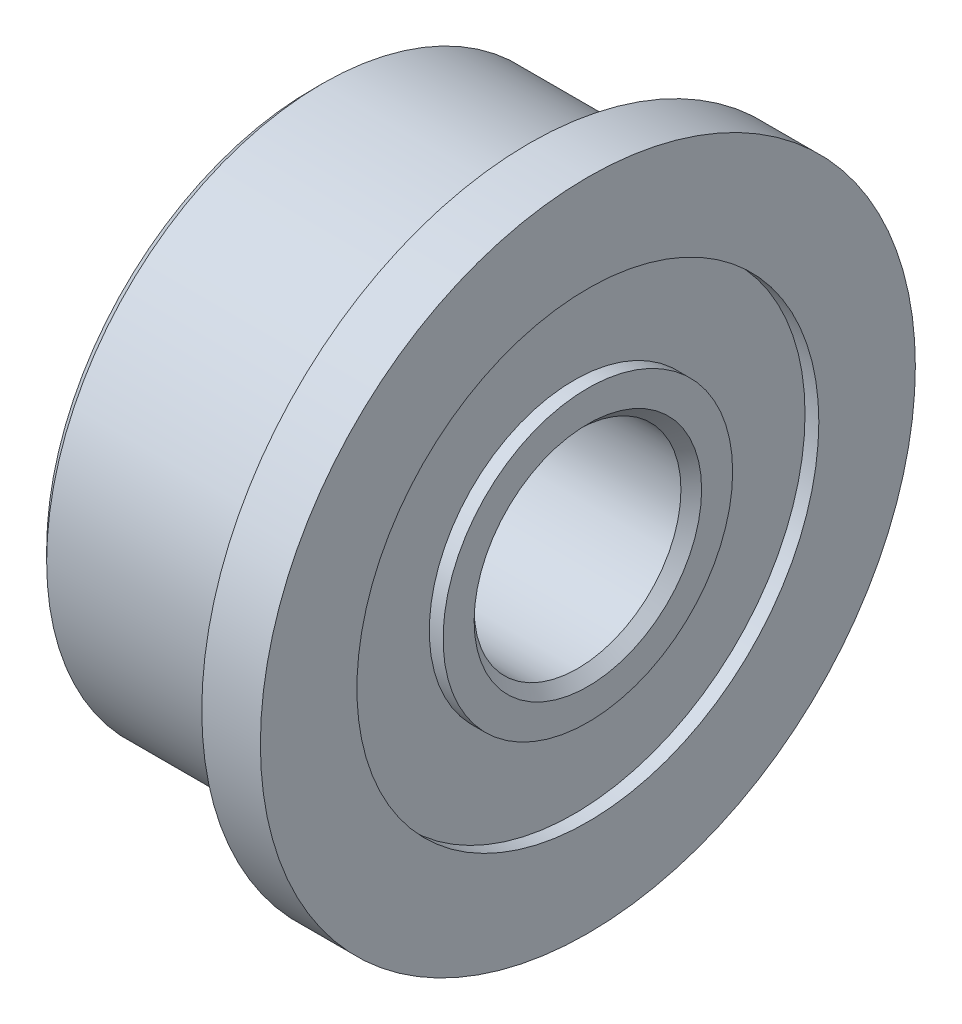
ISO-10303-21;
HEADER;
FILE_DESCRIPTION(('STEP AP214'),'2;1');
FILE_NAME('part.step','',(''),(''),'','','');
FILE_SCHEMA(('AUTOMOTIVE_DESIGN { 1 0 10303 214 1 1 1 1 }'));
ENDSEC;
DATA;
#1=APPLICATION_CONTEXT('core data for automotive mechanical design processes');
#2=APPLICATION_PROTOCOL_DEFINITION('international standard','automotive_design',2000,#1);
#3=PRODUCT_CONTEXT('',#1,'mechanical');
#4=PRODUCT('Part','Part','',(#3));
#5=PRODUCT_RELATED_PRODUCT_CATEGORY('part','',(#4));
#6=PRODUCT_DEFINITION_FORMATION('','',#4);
#7=PRODUCT_DEFINITION_CONTEXT('part definition',#1,'design');
#8=PRODUCT_DEFINITION('design','',#6,#7);
#9=PRODUCT_DEFINITION_SHAPE('','',#8);
#10=(LENGTH_UNIT() NAMED_UNIT(*) SI_UNIT(.MILLI.,.METRE.));
#11=(NAMED_UNIT(*) PLANE_ANGLE_UNIT() SI_UNIT($,.RADIAN.));
#12=(NAMED_UNIT(*) SI_UNIT($,.STERADIAN.) SOLID_ANGLE_UNIT());
#13=UNCERTAINTY_MEASURE_WITH_UNIT(LENGTH_MEASURE(1.E-05),#10,'distance_accuracy_value','');
#14=(GEOMETRIC_REPRESENTATION_CONTEXT(3) GLOBAL_UNCERTAINTY_ASSIGNED_CONTEXT((#13)) GLOBAL_UNIT_ASSIGNED_CONTEXT((#10,
#11,#12)) REPRESENTATION_CONTEXT('',''));
#15=CARTESIAN_POINT('',(0.,0.,0.));
#16=DIRECTION('',(0.,0.,1.));
#17=DIRECTION('',(1.,0.,0.));
#18=AXIS2_PLACEMENT_3D('',#15,#16,#17);
#19=CARTESIAN_POINT('',(-4.,2.1,0.));
#20=DIRECTION('',(-1.,0.,0.));
#21=DIRECTION('',(0.,0.,1.));
#22=AXIS2_PLACEMENT_3D('',#19,#20,#21);
#23=PLANE('',#22);
#24=CARTESIAN_POINT('',(-4.,0.,0.));
#25=DIRECTION('',(1.,0.,0.));
#26=DIRECTION('',(0.,0.,-1.));
#27=AXIS2_PLACEMENT_3D('',#24,#25,#26);
#28=CIRCLE('',#27,2.1);
#29=CARTESIAN_POINT('',(-4.,0.,-2.1));
#30=VERTEX_POINT('',#29);
#31=EDGE_CURVE('E77',#30,#30,#28,.T.);
#32=ORIENTED_EDGE('',*,*,#31,.F.);
#33=EDGE_LOOP('',(#32));
#34=FACE_BOUND('',#33,.T.);
#35=CARTESIAN_POINT('',(-4.,0.,0.));
#36=DIRECTION('',(-1.,0.,0.));
#37=DIRECTION('',(0.,0.,1.));
#38=AXIS2_PLACEMENT_3D('',#35,#36,#37);
#39=CIRCLE('',#38,1.65);
#40=CARTESIAN_POINT('',(-4.,0.,1.65));
#41=VERTEX_POINT('',#40);
#42=EDGE_CURVE('E89',#41,#41,#39,.F.);
#43=ORIENTED_EDGE('',*,*,#42,.T.);
#44=EDGE_LOOP('',(#43));
#45=FACE_BOUND('',#44,.T.);
#46=ADVANCED_FACE('F14',(#34,#45),#23,.T.);
#47=CARTESIAN_POINT('',(0.,1.5,0.));
#48=DIRECTION('',(1.,0.,0.));
#49=DIRECTION('',(0.,0.,-1.));
#50=AXIS2_PLACEMENT_3D('',#47,#48,#49);
#51=PLANE('',#50);
#52=CARTESIAN_POINT('',(0.,0.,0.));
#53=DIRECTION('',(1.,0.,0.));
#54=DIRECTION('',(0.,0.,-1.));
#55=AXIS2_PLACEMENT_3D('',#52,#53,#54);
#56=CIRCLE('',#55,2.1);
#57=CARTESIAN_POINT('',(0.,0.,-2.1));
#58=VERTEX_POINT('',#57);
#59=EDGE_CURVE('E29',#58,#58,#56,.T.);
#60=ORIENTED_EDGE('',*,*,#59,.T.);
#61=EDGE_LOOP('',(#60));
#62=FACE_BOUND('',#61,.T.);
#63=CARTESIAN_POINT('',(0.,0.,0.));
#64=DIRECTION('',(1.,0.,0.));
#65=DIRECTION('',(0.,0.,-1.));
#66=AXIS2_PLACEMENT_3D('',#63,#64,#65);
#67=CIRCLE('',#66,1.65);
#68=CARTESIAN_POINT('',(0.,0.,-1.65));
#69=VERTEX_POINT('',#68);
#70=EDGE_CURVE('E93',#69,#69,#67,.F.);
#71=ORIENTED_EDGE('',*,*,#70,.T.);
#72=EDGE_LOOP('',(#71));
#73=FACE_BOUND('',#72,.T.);
#74=ADVANCED_FACE('F101',(#62,#73),#51,.T.);
#75=CARTESIAN_POINT('',(0.,0.,0.));
#76=DIRECTION('',(1.,0.,0.));
#77=DIRECTION('',(0.,0.,-1.));
#78=AXIS2_PLACEMENT_3D('',#75,#76,#77);
#79=CYLINDRICAL_SURFACE('',#78,2.1);
#80=CARTESIAN_POINT('',(-0.2,0.,0.));
#81=DIRECTION('',(1.,0.,0.));
#82=DIRECTION('',(0.,0.,-1.));
#83=AXIS2_PLACEMENT_3D('',#80,#81,#82);
#84=CIRCLE('',#83,2.1);
#85=CARTESIAN_POINT('',(-0.2,0.,-2.1));
#86=VERTEX_POINT('',#85);
#87=EDGE_CURVE('E35',#86,#86,#84,.T.);
#88=ORIENTED_EDGE('',*,*,#87,.T.);
#89=EDGE_LOOP('',(#88));
#90=FACE_BOUND('',#89,.T.);
#91=ORIENTED_EDGE('',*,*,#59,.F.);
#92=EDGE_LOOP('',(#91));
#93=FACE_BOUND('',#92,.T.);
#94=ADVANCED_FACE('F127',(#90,#93),#79,.T.);
#95=CARTESIAN_POINT('',(-0.2,3.35,0.));
#96=DIRECTION('',(1.,0.,0.));
#97=DIRECTION('',(0.,0.,-1.));
#98=AXIS2_PLACEMENT_3D('',#95,#96,#97);
#99=PLANE('',#98);
#100=CARTESIAN_POINT('',(-0.2,0.,0.));
#101=DIRECTION('',(1.,0.,0.));
#102=DIRECTION('',(0.,0.,-1.));
#103=AXIS2_PLACEMENT_3D('',#100,#101,#102);
#104=CIRCLE('',#103,3.35);
#105=CARTESIAN_POINT('',(-0.2,0.,-3.35));
#106=VERTEX_POINT('',#105);
#107=EDGE_CURVE('E41',#106,#106,#104,.T.);
#108=ORIENTED_EDGE('',*,*,#107,.T.);
#109=EDGE_LOOP('',(#108));
#110=FACE_BOUND('',#109,.T.);
#111=ORIENTED_EDGE('',*,*,#87,.F.);
#112=EDGE_LOOP('',(#111));
#113=FACE_BOUND('',#112,.T.);
#114=ADVANCED_FACE('F134',(#110,#113),#99,.T.);
#115=CARTESIAN_POINT('',(0.,0.,0.));
#116=DIRECTION('',(1.,0.,0.));
#117=DIRECTION('',(0.,0.,-1.));
#118=AXIS2_PLACEMENT_3D('',#115,#116,#117);
#119=CYLINDRICAL_SURFACE('',#118,3.35);
#120=CARTESIAN_POINT('',(0.,0.,0.));
#121=DIRECTION('',(1.,0.,0.));
#122=DIRECTION('',(0.,0.,-1.));
#123=AXIS2_PLACEMENT_3D('',#120,#121,#122);
#124=CIRCLE('',#123,3.35);
#125=CARTESIAN_POINT('',(0.,0.,-3.35));
#126=VERTEX_POINT('',#125);
#127=EDGE_CURVE('E45',#126,#126,#124,.T.);
#128=ORIENTED_EDGE('',*,*,#127,.T.);
#129=EDGE_LOOP('',(#128));
#130=FACE_BOUND('',#129,.T.);
#131=ORIENTED_EDGE('',*,*,#107,.F.);
#132=EDGE_LOOP('',(#131));
#133=FACE_BOUND('',#132,.T.);
#134=ADVANCED_FACE('F138',(#130,#133),#119,.F.);
#135=CARTESIAN_POINT('',(0.,3.35,0.));
#136=DIRECTION('',(1.,0.,0.));
#137=DIRECTION('',(0.,0.,-1.));
#138=AXIS2_PLACEMENT_3D('',#135,#136,#137);
#139=PLANE('',#138);
#140=CARTESIAN_POINT('',(0.,0.,0.));
#141=DIRECTION('',(1.,0.,0.));
#142=DIRECTION('',(0.,0.,-1.));
#143=AXIS2_PLACEMENT_3D('',#140,#141,#142);
#144=CIRCLE('',#143,4.75);
#145=CARTESIAN_POINT('',(0.,0.,-4.75));
#146=VERTEX_POINT('',#145);
#147=EDGE_CURVE('E49',#146,#146,#144,.T.);
#148=ORIENTED_EDGE('',*,*,#147,.T.);
#149=EDGE_LOOP('',(#148));
#150=FACE_BOUND('',#149,.T.);
#151=ORIENTED_EDGE('',*,*,#127,.F.);
#152=EDGE_LOOP('',(#151));
#153=FACE_BOUND('',#152,.T.);
#154=ADVANCED_FACE('F142',(#150,#153),#139,.T.);
#155=CARTESIAN_POINT('',(0.,0.,0.));
#156=DIRECTION('',(1.,0.,0.));
#157=DIRECTION('',(0.,0.,-1.));
#158=AXIS2_PLACEMENT_3D('',#155,#156,#157);
#159=CYLINDRICAL_SURFACE('',#158,4.75);
#160=CARTESIAN_POINT('',(-0.85,0.,0.));
#161=DIRECTION('',(1.,0.,0.));
#162=DIRECTION('',(0.,0.,-1.));
#163=AXIS2_PLACEMENT_3D('',#160,#161,#162);
#164=CIRCLE('',#163,4.75);
#165=CARTESIAN_POINT('',(-0.85,0.,-4.75));
#166=VERTEX_POINT('',#165);
#167=EDGE_CURVE('E53',#166,#166,#164,.T.);
#168=ORIENTED_EDGE('',*,*,#167,.T.);
#169=EDGE_LOOP('',(#168));
#170=FACE_BOUND('',#169,.T.);
#171=ORIENTED_EDGE('',*,*,#147,.F.);
#172=EDGE_LOOP('',(#171));
#173=FACE_BOUND('',#172,.T.);
#174=ADVANCED_FACE('F146',(#170,#173),#159,.T.);
#175=CARTESIAN_POINT('',(-0.85,4.75,0.));
#176=DIRECTION('',(-1.,0.,0.));
#177=DIRECTION('',(0.,0.,1.));
#178=AXIS2_PLACEMENT_3D('',#175,#176,#177);
#179=PLANE('',#178);
#180=CARTESIAN_POINT('',(-0.85,0.,0.));
#181=DIRECTION('',(1.,0.,0.));
#182=DIRECTION('',(0.,0.,-1.));
#183=AXIS2_PLACEMENT_3D('',#180,#181,#182);
#184=CIRCLE('',#183,4.02);
#185=CARTESIAN_POINT('',(-0.85,0.,-4.02));
#186=VERTEX_POINT('',#185);
#187=EDGE_CURVE('E57',#186,#186,#184,.T.);
#188=ORIENTED_EDGE('',*,*,#187,.T.);
#189=EDGE_LOOP('',(#188));
#190=FACE_BOUND('',#189,.T.);
#191=ORIENTED_EDGE('',*,*,#167,.F.);
#192=EDGE_LOOP('',(#191));
#193=FACE_BOUND('',#192,.T.);
#194=ADVANCED_FACE('F150',(#190,#193),#179,.T.);
#195=CARTESIAN_POINT('',(-0.85,0.,0.));
#196=DIRECTION('',(1.,0.,0.));
#197=DIRECTION('',(0.,0.,-1.));
#198=AXIS2_PLACEMENT_3D('',#195,#196,#197);
#199=TOROIDAL_SURFACE('',#198,4.,0.0200000000000001);
#200=CARTESIAN_POINT('',(-0.87,0.,0.));
#201=DIRECTION('',(1.,0.,0.));
#202=DIRECTION('',(0.,0.,-1.));
#203=AXIS2_PLACEMENT_3D('',#200,#201,#202);
#204=CIRCLE('',#203,4.);
#205=CARTESIAN_POINT('',(-0.87,0.,-4.));
#206=VERTEX_POINT('',#205);
#207=EDGE_CURVE('E61',#206,#206,#204,.T.);
#208=ORIENTED_EDGE('',*,*,#207,.T.);
#209=EDGE_LOOP('',(#208));
#210=FACE_BOUND('',#209,.T.);
#211=ORIENTED_EDGE('',*,*,#187,.F.);
#212=EDGE_LOOP('',(#211));
#213=FACE_BOUND('',#212,.T.);
#214=ADVANCED_FACE('F154',(#210,#213),#199,.F.);
#215=CARTESIAN_POINT('',(0.,0.,0.));
#216=DIRECTION('',(1.,0.,0.));
#217=DIRECTION('',(0.,0.,-1.));
#218=AXIS2_PLACEMENT_3D('',#215,#216,#217);
#219=CYLINDRICAL_SURFACE('',#218,4.);
#220=CARTESIAN_POINT('',(-3.85,0.,0.));
#221=DIRECTION('',(-1.,0.,0.));
#222=DIRECTION('',(0.,0.,1.));
#223=AXIS2_PLACEMENT_3D('',#220,#221,#222);
#224=CIRCLE('',#223,4.);
#225=CARTESIAN_POINT('',(-3.85,0.,4.));
#226=VERTEX_POINT('',#225);
#227=EDGE_CURVE('E22',#226,#226,#224,.F.);
#228=ORIENTED_EDGE('',*,*,#227,.T.);
#229=EDGE_LOOP('',(#228));
#230=FACE_BOUND('',#229,.T.);
#231=ORIENTED_EDGE('',*,*,#207,.F.);
#232=EDGE_LOOP('',(#231));
#233=FACE_BOUND('',#232,.T.);
#234=ADVANCED_FACE('F158',(#230,#233),#219,.T.);
#235=CARTESIAN_POINT('',(-4.,4.,0.));
#236=DIRECTION('',(-1.,0.,0.));
#237=DIRECTION('',(0.,0.,1.));
#238=AXIS2_PLACEMENT_3D('',#235,#236,#237);
#239=PLANE('',#238);
#240=CARTESIAN_POINT('',(-4.,0.,0.));
#241=DIRECTION('',(-1.,0.,0.));
#242=DIRECTION('',(0.,0.,1.));
#243=AXIS2_PLACEMENT_3D('',#240,#241,#242);
#244=CIRCLE('',#243,3.85);
#245=CARTESIAN_POINT('',(-4.,0.,3.85));
#246=VERTEX_POINT('',#245);
#247=EDGE_CURVE('E9',#246,#246,#244,.T.);
#248=ORIENTED_EDGE('',*,*,#247,.T.);
#249=EDGE_LOOP('',(#248));
#250=FACE_BOUND('',#249,.T.);
#251=CARTESIAN_POINT('',(-4.,0.,0.));
#252=DIRECTION('',(1.,0.,0.));
#253=DIRECTION('',(0.,0.,-1.));
#254=AXIS2_PLACEMENT_3D('',#251,#252,#253);
#255=CIRCLE('',#254,3.35);
#256=CARTESIAN_POINT('',(-4.,0.,-3.35));
#257=VERTEX_POINT('',#256);
#258=EDGE_CURVE('E65',#257,#257,#255,.T.);
#259=ORIENTED_EDGE('',*,*,#258,.T.);
#260=EDGE_LOOP('',(#259));
#261=FACE_BOUND('',#260,.T.);
#262=ADVANCED_FACE('F162',(#250,#261),#239,.T.);
#263=CARTESIAN_POINT('',(0.,0.,0.));
#264=DIRECTION('',(1.,0.,0.));
#265=DIRECTION('',(0.,0.,-1.));
#266=AXIS2_PLACEMENT_3D('',#263,#264,#265);
#267=CYLINDRICAL_SURFACE('',#266,3.35);
#268=CARTESIAN_POINT('',(-3.8,0.,0.));
#269=DIRECTION('',(1.,0.,0.));
#270=DIRECTION('',(0.,0.,-1.));
#271=AXIS2_PLACEMENT_3D('',#268,#269,#270);
#272=CIRCLE('',#271,3.35);
#273=CARTESIAN_POINT('',(-3.8,0.,-3.35));
#274=VERTEX_POINT('',#273);
#275=EDGE_CURVE('E69',#274,#274,#272,.T.);
#276=ORIENTED_EDGE('',*,*,#275,.T.);
#277=EDGE_LOOP('',(#276));
#278=FACE_BOUND('',#277,.T.);
#279=ORIENTED_EDGE('',*,*,#258,.F.);
#280=EDGE_LOOP('',(#279));
#281=FACE_BOUND('',#280,.T.);
#282=ADVANCED_FACE('F165',(#278,#281),#267,.F.);
#283=CARTESIAN_POINT('',(-3.8,3.35,0.));
#284=DIRECTION('',(-1.,0.,0.));
#285=DIRECTION('',(0.,0.,1.));
#286=AXIS2_PLACEMENT_3D('',#283,#284,#285);
#287=PLANE('',#286);
#288=CARTESIAN_POINT('',(-3.8,0.,0.));
#289=DIRECTION('',(1.,0.,0.));
#290=DIRECTION('',(0.,0.,-1.));
#291=AXIS2_PLACEMENT_3D('',#288,#289,#290);
#292=CIRCLE('',#291,2.1);
#293=CARTESIAN_POINT('',(-3.8,0.,-2.1));
#294=VERTEX_POINT('',#293);
#295=EDGE_CURVE('E73',#294,#294,#292,.T.);
#296=ORIENTED_EDGE('',*,*,#295,.T.);
#297=EDGE_LOOP('',(#296));
#298=FACE_BOUND('',#297,.T.);
#299=ORIENTED_EDGE('',*,*,#275,.F.);
#300=EDGE_LOOP('',(#299));
#301=FACE_BOUND('',#300,.T.);
#302=ADVANCED_FACE('F168',(#298,#301),#287,.T.);
#303=CARTESIAN_POINT('',(0.,0.,0.));
#304=DIRECTION('',(1.,0.,0.));
#305=DIRECTION('',(0.,0.,-1.));
#306=AXIS2_PLACEMENT_3D('',#303,#304,#305);
#307=CYLINDRICAL_SURFACE('',#306,2.1);
#308=ORIENTED_EDGE('',*,*,#31,.T.);
#309=EDGE_LOOP('',(#308));
#310=FACE_BOUND('',#309,.T.);
#311=ORIENTED_EDGE('',*,*,#295,.F.);
#312=EDGE_LOOP('',(#311));
#313=FACE_BOUND('',#312,.T.);
#314=ADVANCED_FACE('F172',(#310,#313),#307,.T.);
#315=CARTESIAN_POINT('',(-3.85,0.,0.));
#316=DIRECTION('',(1.,0.,0.));
#317=DIRECTION('',(0.,0.,-1.));
#318=AXIS2_PLACEMENT_3D('',#315,#316,#317);
#319=CONICAL_SURFACE('',#318,4.,0.785398163397451);
#320=ORIENTED_EDGE('',*,*,#247,.F.);
#321=EDGE_LOOP('',(#320));
#322=FACE_BOUND('',#321,.T.);
#323=ORIENTED_EDGE('',*,*,#227,.F.);
#324=EDGE_LOOP('',(#323));
#325=FACE_BOUND('',#324,.T.);
#326=ADVANCED_FACE('F16',(#322,#325),#319,.T.);
#327=CARTESIAN_POINT('',(-4.,0.,0.));
#328=DIRECTION('',(-1.,0.,0.));
#329=DIRECTION('',(0.,0.,1.));
#330=AXIS2_PLACEMENT_3D('',#327,#328,#329);
#331=CONICAL_SURFACE('',#330,1.65,0.785398163397448);
#332=CARTESIAN_POINT('',(-3.85,0.,0.));
#333=DIRECTION('',(-1.,0.,0.));
#334=DIRECTION('',(0.,0.,1.));
#335=AXIS2_PLACEMENT_3D('',#332,#333,#334);
#336=CIRCLE('',#335,1.5);
#337=CARTESIAN_POINT('',(-3.85,0.,1.5));
#338=VERTEX_POINT('',#337);
#339=EDGE_CURVE('E81',#338,#338,#336,.T.);
#340=ORIENTED_EDGE('',*,*,#339,.F.);
#341=EDGE_LOOP('',(#340));
#342=FACE_BOUND('',#341,.T.);
#343=ORIENTED_EDGE('',*,*,#42,.F.);
#344=EDGE_LOOP('',(#343));
#345=FACE_BOUND('',#344,.T.);
#346=ADVANCED_FACE('F107',(#342,#345),#331,.F.);
#347=CARTESIAN_POINT('',(-0.150000000000001,0.,0.));
#348=DIRECTION('',(1.,0.,0.));
#349=DIRECTION('',(0.,0.,-1.));
#350=AXIS2_PLACEMENT_3D('',#347,#348,#349);
#351=CONICAL_SURFACE('',#350,1.5,0.785398163397448);
#352=ORIENTED_EDGE('',*,*,#70,.F.);
#353=EDGE_LOOP('',(#352));
#354=FACE_BOUND('',#353,.T.);
#355=CARTESIAN_POINT('',(-0.150000000000001,0.,0.));
#356=DIRECTION('',(1.,0.,0.));
#357=DIRECTION('',(0.,0.,-1.));
#358=AXIS2_PLACEMENT_3D('',#355,#356,#357);
#359=CIRCLE('',#358,1.5);
#360=CARTESIAN_POINT('',(-0.150000000000001,0.,-1.5));
#361=VERTEX_POINT('',#360);
#362=EDGE_CURVE('E85',#361,#361,#359,.T.);
#363=ORIENTED_EDGE('',*,*,#362,.F.);
#364=EDGE_LOOP('',(#363));
#365=FACE_BOUND('',#364,.T.);
#366=ADVANCED_FACE('F103',(#354,#365),#351,.F.);
#367=CARTESIAN_POINT('',(0.,0.,0.));
#368=DIRECTION('',(1.,0.,0.));
#369=DIRECTION('',(0.,0.,-1.));
#370=AXIS2_PLACEMENT_3D('',#367,#368,#369);
#371=CYLINDRICAL_SURFACE('',#370,1.5);
#372=ORIENTED_EDGE('',*,*,#362,.T.);
#373=EDGE_LOOP('',(#372));
#374=FACE_BOUND('',#373,.T.);
#375=ORIENTED_EDGE('',*,*,#339,.T.);
#376=EDGE_LOOP('',(#375));
#377=FACE_BOUND('',#376,.T.);
#378=ADVANCED_FACE('F106',(#374,#377),#371,.F.);
#379=CLOSED_SHELL('',(#46,#74,#94,#114,#134,#154,#174,#194,#214,#234,#262,#282,#302,#314,#326,
#346,#366,#378));
#380=MANIFOLD_SOLID_BREP('B1',#379);
#381=ADVANCED_BREP_SHAPE_REPRESENTATION('',(#18,#380),#14);
#382=SHAPE_DEFINITION_REPRESENTATION(#9,#381);
ENDSEC;
END-ISO-10303-21;
